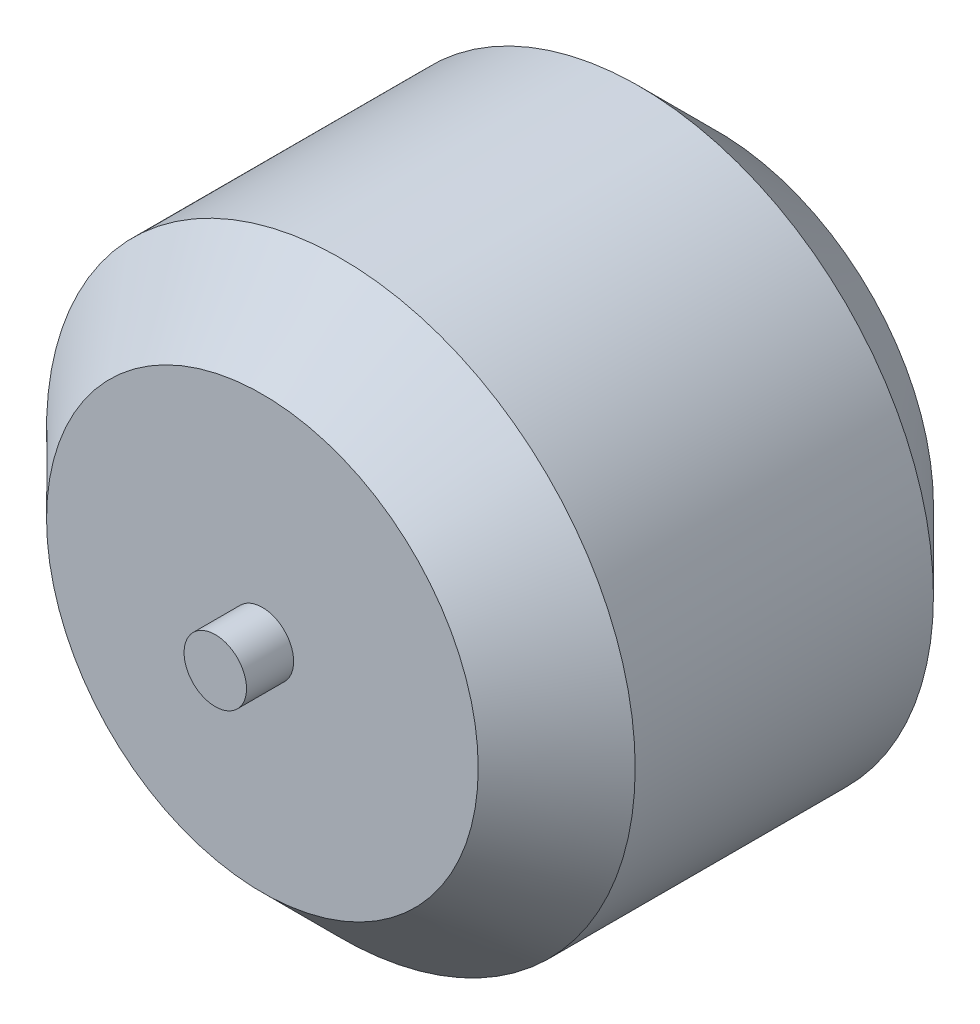
ISO-10303-21;
HEADER;
FILE_DESCRIPTION(('STEP AP214'),'2;1');
FILE_NAME('part.step','',(''),(''),'','','');
FILE_SCHEMA(('AUTOMOTIVE_DESIGN { 1 0 10303 214 1 1 1 1 }'));
ENDSEC;
DATA;
#1=APPLICATION_CONTEXT('core data for automotive mechanical design processes');
#2=APPLICATION_PROTOCOL_DEFINITION('international standard','automotive_design',2000,#1);
#3=PRODUCT_CONTEXT('',#1,'mechanical');
#4=PRODUCT('Part','Part','',(#3));
#5=PRODUCT_RELATED_PRODUCT_CATEGORY('part','',(#4));
#6=PRODUCT_DEFINITION_FORMATION('','',#4);
#7=PRODUCT_DEFINITION_CONTEXT('part definition',#1,'design');
#8=PRODUCT_DEFINITION('design','',#6,#7);
#9=PRODUCT_DEFINITION_SHAPE('','',#8);
#10=(LENGTH_UNIT() NAMED_UNIT(*) SI_UNIT(.MILLI.,.METRE.));
#11=(NAMED_UNIT(*) PLANE_ANGLE_UNIT() SI_UNIT($,.RADIAN.));
#12=(NAMED_UNIT(*) SI_UNIT($,.STERADIAN.) SOLID_ANGLE_UNIT());
#13=UNCERTAINTY_MEASURE_WITH_UNIT(LENGTH_MEASURE(1.E-05),#10,'distance_accuracy_value','');
#14=(GEOMETRIC_REPRESENTATION_CONTEXT(3) GLOBAL_UNCERTAINTY_ASSIGNED_CONTEXT((#13)) GLOBAL_UNIT_ASSIGNED_CONTEXT((#10,
#11,#12)) REPRESENTATION_CONTEXT('',''));
#15=CARTESIAN_POINT('',(0.,0.,0.));
#16=DIRECTION('',(0.,0.,1.));
#17=DIRECTION('',(1.,0.,0.));
#18=AXIS2_PLACEMENT_3D('',#15,#16,#17);
#19=CARTESIAN_POINT('',(0.,0.,29.));
#20=DIRECTION('',(0.,0.,-1.));
#21=DIRECTION('',(-1.,0.,0.));
#22=AXIS2_PLACEMENT_3D('',#19,#20,#21);
#23=CYLINDRICAL_SURFACE('',#22,18.75);
#24=CARTESIAN_POINT('',(0.,0.,5.00000000000004));
#25=DIRECTION('',(0.,0.,1.));
#26=DIRECTION('',(1.,0.,0.));
#27=AXIS2_PLACEMENT_3D('',#24,#25,#26);
#28=CIRCLE('',#27,18.75);
#29=CARTESIAN_POINT('',(18.75,0.,5.00000000000004));
#30=VERTEX_POINT('',#29);
#31=EDGE_CURVE('E58',#30,#30,#28,.T.);
#32=ORIENTED_EDGE('',*,*,#31,.T.);
#33=EDGE_LOOP('',(#32));
#34=FACE_BOUND('',#33,.T.);
#35=CARTESIAN_POINT('',(0.,0.,24.));
#36=DIRECTION('',(0.,0.,1.));
#37=DIRECTION('',(1.,0.,0.));
#38=AXIS2_PLACEMENT_3D('',#35,#36,#37);
#39=CIRCLE('',#38,18.75);
#40=CARTESIAN_POINT('',(18.75,0.,24.));
#41=VERTEX_POINT('',#40);
#42=EDGE_CURVE('E64',#41,#41,#39,.F.);
#43=ORIENTED_EDGE('',*,*,#42,.T.);
#44=EDGE_LOOP('',(#43));
#45=FACE_BOUND('',#44,.T.);
#46=ADVANCED_FACE('F39',(#34,#45),#23,.T.);
#47=CARTESIAN_POINT('',(0.,0.,29.));
#48=DIRECTION('',(0.,0.,1.));
#49=DIRECTION('',(1.,0.,0.));
#50=AXIS2_PLACEMENT_3D('',#47,#48,#49);
#51=PLANE('',#50);
#52=CARTESIAN_POINT('',(0.,0.,29.));
#53=DIRECTION('',(0.,0.,1.));
#54=DIRECTION('',(1.,0.,0.));
#55=AXIS2_PLACEMENT_3D('',#52,#53,#54);
#56=CIRCLE('',#55,13.75);
#57=CARTESIAN_POINT('',(13.75,0.,29.));
#58=VERTEX_POINT('',#57);
#59=EDGE_CURVE('E48',#58,#58,#56,.T.);
#60=ORIENTED_EDGE('',*,*,#59,.T.);
#61=EDGE_LOOP('',(#60));
#62=FACE_BOUND('',#61,.T.);
#63=CARTESIAN_POINT('',(0.,0.,29.));
#64=DIRECTION('',(0.,0.,1.));
#65=DIRECTION('',(1.,0.,0.));
#66=AXIS2_PLACEMENT_3D('',#63,#64,#65);
#67=CIRCLE('',#66,1.99);
#68=CARTESIAN_POINT('',(1.99,0.,29.));
#69=VERTEX_POINT('',#68);
#70=EDGE_CURVE('E69',#69,#69,#67,.T.);
#71=ORIENTED_EDGE('',*,*,#70,.F.);
#72=EDGE_LOOP('',(#71));
#73=FACE_BOUND('',#72,.T.);
#74=ADVANCED_FACE('F126',(#62,#73),#51,.T.);
#75=CARTESIAN_POINT('',(0.,0.,0.));
#76=DIRECTION('',(0.,0.,1.));
#77=DIRECTION('',(1.,0.,0.));
#78=AXIS2_PLACEMENT_3D('',#75,#76,#77);
#79=PLANE('',#78);
#80=CARTESIAN_POINT('',(8.,0.,0.));
#81=DIRECTION('',(0.,0.,-1.));
#82=DIRECTION('',(0.,1.,0.));
#83=AXIS2_PLACEMENT_3D('',#80,#81,#82);
#84=CIRCLE('',#83,1.5);
#85=CARTESIAN_POINT('',(8.00000000000001,1.49999999999997,0.));
#86=VERTEX_POINT('',#85);
#87=EDGE_CURVE('E105',#86,#86,#84,.T.);
#88=ORIENTED_EDGE('',*,*,#87,.F.);
#89=EDGE_LOOP('',(#88));
#90=FACE_BOUND('',#89,.T.);
#91=CARTESIAN_POINT('',(0.,-8.,0.));
#92=DIRECTION('',(0.,0.,-1.));
#93=DIRECTION('',(1.,0.,0.));
#94=AXIS2_PLACEMENT_3D('',#91,#92,#93);
#95=CIRCLE('',#94,1.5);
#96=CARTESIAN_POINT('',(1.5,-8.,0.));
#97=VERTEX_POINT('',#96);
#98=EDGE_CURVE('E97',#97,#97,#95,.T.);
#99=ORIENTED_EDGE('',*,*,#98,.F.);
#100=EDGE_LOOP('',(#99));
#101=FACE_BOUND('',#100,.T.);
#102=CARTESIAN_POINT('',(-8.,0.,0.));
#103=DIRECTION('',(0.,0.,-1.));
#104=DIRECTION('',(0.,-1.,0.));
#105=AXIS2_PLACEMENT_3D('',#102,#103,#104);
#106=CIRCLE('',#105,1.5);
#107=CARTESIAN_POINT('',(-8.00000000000002,-1.49999999999992,0.));
#108=VERTEX_POINT('',#107);
#109=EDGE_CURVE('E89',#108,#108,#106,.T.);
#110=ORIENTED_EDGE('',*,*,#109,.F.);
#111=EDGE_LOOP('',(#110));
#112=FACE_BOUND('',#111,.T.);
#113=CARTESIAN_POINT('',(0.,8.,0.));
#114=DIRECTION('',(0.,0.,-1.));
#115=DIRECTION('',(-1.,0.,0.));
#116=AXIS2_PLACEMENT_3D('',#113,#114,#115);
#117=CIRCLE('',#116,1.5);
#118=CARTESIAN_POINT('',(-1.5,8.,0.));
#119=VERTEX_POINT('',#118);
#120=EDGE_CURVE('E81',#119,#119,#117,.T.);
#121=ORIENTED_EDGE('',*,*,#120,.F.);
#122=EDGE_LOOP('',(#121));
#123=FACE_BOUND('',#122,.T.);
#124=CARTESIAN_POINT('',(0.,0.,0.));
#125=DIRECTION('',(0.,0.,1.));
#126=DIRECTION('',(1.,0.,0.));
#127=AXIS2_PLACEMENT_3D('',#124,#125,#126);
#128=CIRCLE('',#127,1.99);
#129=CARTESIAN_POINT('',(1.99,0.,0.));
#130=VERTEX_POINT('',#129);
#131=EDGE_CURVE('E10',#130,#130,#128,.F.);
#132=ORIENTED_EDGE('',*,*,#131,.F.);
#133=EDGE_LOOP('',(#132));
#134=FACE_BOUND('',#133,.T.);
#135=CARTESIAN_POINT('',(0.,0.,0.));
#136=DIRECTION('',(0.,0.,1.));
#137=DIRECTION('',(1.,0.,0.));
#138=AXIS2_PLACEMENT_3D('',#135,#136,#137);
#139=CIRCLE('',#138,13.7499999999999);
#140=CARTESIAN_POINT('',(13.7499999999999,0.,0.));
#141=VERTEX_POINT('',#140);
#142=EDGE_CURVE('E53',#141,#141,#139,.F.);
#143=ORIENTED_EDGE('',*,*,#142,.T.);
#144=EDGE_LOOP('',(#143));
#145=FACE_BOUND('',#144,.T.);
#146=ADVANCED_FACE('F122',(#90,#101,#112,#123,#134,#145),#79,.F.);
#147=CARTESIAN_POINT('',(0.,0.,32.));
#148=DIRECTION('',(0.,0.,-1.));
#149=DIRECTION('',(-1.,0.,0.));
#150=AXIS2_PLACEMENT_3D('',#147,#148,#149);
#151=CYLINDRICAL_SURFACE('',#150,1.99);
#152=CARTESIAN_POINT('',(0.,0.,32.));
#153=DIRECTION('',(0.,0.,1.));
#154=DIRECTION('',(1.,0.,0.));
#155=AXIS2_PLACEMENT_3D('',#152,#153,#154);
#156=CIRCLE('',#155,1.99);
#157=CARTESIAN_POINT('',(1.99,0.,32.));
#158=VERTEX_POINT('',#157);
#159=EDGE_CURVE('E68',#158,#158,#156,.T.);
#160=ORIENTED_EDGE('',*,*,#159,.F.);
#161=EDGE_LOOP('',(#160));
#162=FACE_BOUND('',#161,.T.);
#163=ORIENTED_EDGE('',*,*,#70,.T.);
#164=EDGE_LOOP('',(#163));
#165=FACE_BOUND('',#164,.T.);
#166=ADVANCED_FACE('F125',(#162,#165),#151,.T.);
#167=CARTESIAN_POINT('',(0.,0.,32.));
#168=DIRECTION('',(0.,0.,1.));
#169=DIRECTION('',(1.,0.,0.));
#170=AXIS2_PLACEMENT_3D('',#167,#168,#169);
#171=PLANE('',#170);
#172=ORIENTED_EDGE('',*,*,#159,.T.);
#173=EDGE_LOOP('',(#172));
#174=FACE_BOUND('',#173,.T.);
#175=ADVANCED_FACE('F140',(#174),#171,.T.);
#176=CARTESIAN_POINT('',(0.,0.,5.00000000000004));
#177=DIRECTION('',(0.,0.,1.));
#178=DIRECTION('',(1.,0.,0.));
#179=AXIS2_PLACEMENT_3D('',#176,#177,#178);
#180=CONICAL_SURFACE('',#179,18.75,0.78539816339745);
#181=ORIENTED_EDGE('',*,*,#142,.F.);
#182=EDGE_LOOP('',(#181));
#183=FACE_BOUND('',#182,.T.);
#184=ORIENTED_EDGE('',*,*,#31,.F.);
#185=EDGE_LOOP('',(#184));
#186=FACE_BOUND('',#185,.T.);
#187=ADVANCED_FACE('F137',(#183,#186),#180,.T.);
#188=CARTESIAN_POINT('',(0.,0.,29.));
#189=DIRECTION('',(0.,0.,-1.));
#190=DIRECTION('',(-1.,0.,0.));
#191=AXIS2_PLACEMENT_3D('',#188,#189,#190);
#192=CONICAL_SURFACE('',#191,13.75,0.785398163397447);
#193=ORIENTED_EDGE('',*,*,#42,.F.);
#194=EDGE_LOOP('',(#193));
#195=FACE_BOUND('',#194,.T.);
#196=ORIENTED_EDGE('',*,*,#59,.F.);
#197=EDGE_LOOP('',(#196));
#198=FACE_BOUND('',#197,.T.);
#199=ADVANCED_FACE('F42',(#195,#198),#192,.T.);
#200=CARTESIAN_POINT('',(0.,0.,-1.));
#201=DIRECTION('',(0.,0.,1.));
#202=DIRECTION('',(1.,0.,0.));
#203=AXIS2_PLACEMENT_3D('',#200,#201,#202);
#204=CYLINDRICAL_SURFACE('',#203,1.99);
#205=CARTESIAN_POINT('',(0.,0.,-1.));
#206=DIRECTION('',(0.,0.,-1.));
#207=DIRECTION('',(-1.,0.,0.));
#208=AXIS2_PLACEMENT_3D('',#205,#206,#207);
#209=CIRCLE('',#208,1.99);
#210=CARTESIAN_POINT('',(-1.99,0.,-1.));
#211=VERTEX_POINT('',#210);
#212=EDGE_CURVE('E73',#211,#211,#209,.T.);
#213=ORIENTED_EDGE('',*,*,#212,.F.);
#214=EDGE_LOOP('',(#213));
#215=FACE_BOUND('',#214,.T.);
#216=ORIENTED_EDGE('',*,*,#131,.T.);
#217=EDGE_LOOP('',(#216));
#218=FACE_BOUND('',#217,.T.);
#219=ADVANCED_FACE('F150',(#215,#218),#204,.T.);
#220=CARTESIAN_POINT('',(0.,0.,-1.));
#221=DIRECTION('',(0.,0.,-1.));
#222=DIRECTION('',(-1.,0.,0.));
#223=AXIS2_PLACEMENT_3D('',#220,#221,#222);
#224=PLANE('',#223);
#225=ORIENTED_EDGE('',*,*,#212,.T.);
#226=EDGE_LOOP('',(#225));
#227=FACE_BOUND('',#226,.T.);
#228=ADVANCED_FACE('F154',(#227),#224,.T.);
#229=CARTESIAN_POINT('',(0.,8.,1.));
#230=DIRECTION('',(0.,0.,-1.));
#231=DIRECTION('',(-1.,0.,0.));
#232=AXIS2_PLACEMENT_3D('',#229,#230,#231);
#233=CYLINDRICAL_SURFACE('',#232,1.5);
#234=CARTESIAN_POINT('',(0.,8.,1.));
#235=DIRECTION('',(0.,0.,-1.));
#236=DIRECTION('',(-1.,0.,0.));
#237=AXIS2_PLACEMENT_3D('',#234,#235,#236);
#238=CIRCLE('',#237,1.5);
#239=CARTESIAN_POINT('',(-1.5,8.,1.));
#240=VERTEX_POINT('',#239);
#241=EDGE_CURVE('E80',#240,#240,#238,.T.);
#242=ORIENTED_EDGE('',*,*,#241,.F.);
#243=EDGE_LOOP('',(#242));
#244=FACE_BOUND('',#243,.T.);
#245=ORIENTED_EDGE('',*,*,#120,.T.);
#246=EDGE_LOOP('',(#245));
#247=FACE_BOUND('',#246,.T.);
#248=ADVANCED_FACE('F160',(#244,#247),#233,.F.);
#249=CARTESIAN_POINT('',(0.,8.,1.));
#250=DIRECTION('',(0.,0.,-1.));
#251=DIRECTION('',(-1.,0.,0.));
#252=AXIS2_PLACEMENT_3D('',#249,#250,#251);
#253=PLANE('',#252);
#254=ORIENTED_EDGE('',*,*,#241,.T.);
#255=EDGE_LOOP('',(#254));
#256=FACE_BOUND('',#255,.T.);
#257=ADVANCED_FACE('F225',(#256),#253,.T.);
#258=CARTESIAN_POINT('',(-8.,0.,1.));
#259=DIRECTION('',(0.,0.,-1.));
#260=DIRECTION('',(-1.,0.,0.));
#261=AXIS2_PLACEMENT_3D('',#258,#259,#260);
#262=CYLINDRICAL_SURFACE('',#261,1.5);
#263=CARTESIAN_POINT('',(-8.,0.,1.));
#264=DIRECTION('',(0.,0.,-1.));
#265=DIRECTION('',(0.,-1.,0.));
#266=AXIS2_PLACEMENT_3D('',#263,#264,#265);
#267=CIRCLE('',#266,1.5);
#268=CARTESIAN_POINT('',(-8.00000000000002,-1.49999999999992,1.));
#269=VERTEX_POINT('',#268);
#270=EDGE_CURVE('E93',#269,#269,#267,.T.);
#271=ORIENTED_EDGE('',*,*,#270,.F.);
#272=EDGE_LOOP('',(#271));
#273=FACE_BOUND('',#272,.T.);
#274=ORIENTED_EDGE('',*,*,#109,.T.);
#275=EDGE_LOOP('',(#274));
#276=FACE_BOUND('',#275,.T.);
#277=ADVANCED_FACE('F233',(#273,#276),#262,.F.);
#278=CARTESIAN_POINT('',(-8.,0.,1.));
#279=DIRECTION('',(0.,0.,-1.));
#280=DIRECTION('',(0.,-1.,0.));
#281=AXIS2_PLACEMENT_3D('',#278,#279,#280);
#282=PLANE('',#281);
#283=ORIENTED_EDGE('',*,*,#270,.T.);
#284=EDGE_LOOP('',(#283));
#285=FACE_BOUND('',#284,.T.);
#286=ADVANCED_FACE('F243',(#285),#282,.T.);
#287=CARTESIAN_POINT('',(0.,-8.,1.));
#288=DIRECTION('',(0.,0.,-1.));
#289=DIRECTION('',(-1.,0.,0.));
#290=AXIS2_PLACEMENT_3D('',#287,#288,#289);
#291=CYLINDRICAL_SURFACE('',#290,1.5);
#292=CARTESIAN_POINT('',(0.,-8.,1.));
#293=DIRECTION('',(0.,0.,-1.));
#294=DIRECTION('',(1.,0.,0.));
#295=AXIS2_PLACEMENT_3D('',#292,#293,#294);
#296=CIRCLE('',#295,1.5);
#297=CARTESIAN_POINT('',(1.5,-8.,1.));
#298=VERTEX_POINT('',#297);
#299=EDGE_CURVE('E101',#298,#298,#296,.T.);
#300=ORIENTED_EDGE('',*,*,#299,.F.);
#301=EDGE_LOOP('',(#300));
#302=FACE_BOUND('',#301,.T.);
#303=ORIENTED_EDGE('',*,*,#98,.T.);
#304=EDGE_LOOP('',(#303));
#305=FACE_BOUND('',#304,.T.);
#306=ADVANCED_FACE('F250',(#302,#305),#291,.F.);
#307=CARTESIAN_POINT('',(0.,-8.,1.));
#308=DIRECTION('',(0.,0.,-1.));
#309=DIRECTION('',(1.,0.,0.));
#310=AXIS2_PLACEMENT_3D('',#307,#308,#309);
#311=PLANE('',#310);
#312=ORIENTED_EDGE('',*,*,#299,.T.);
#313=EDGE_LOOP('',(#312));
#314=FACE_BOUND('',#313,.T.);
#315=ADVANCED_FACE('F118',(#314),#311,.T.);
#316=CARTESIAN_POINT('',(8.,0.,1.));
#317=DIRECTION('',(0.,0.,-1.));
#318=DIRECTION('',(-1.,0.,0.));
#319=AXIS2_PLACEMENT_3D('',#316,#317,#318);
#320=CYLINDRICAL_SURFACE('',#319,1.5);
#321=CARTESIAN_POINT('',(8.,0.,1.));
#322=DIRECTION('',(0.,0.,-1.));
#323=DIRECTION('',(0.,1.,0.));
#324=AXIS2_PLACEMENT_3D('',#321,#322,#323);
#325=CIRCLE('',#324,1.5);
#326=CARTESIAN_POINT('',(8.00000000000001,1.49999999999997,1.));
#327=VERTEX_POINT('',#326);
#328=EDGE_CURVE('E85',#327,#327,#325,.T.);
#329=ORIENTED_EDGE('',*,*,#328,.F.);
#330=EDGE_LOOP('',(#329));
#331=FACE_BOUND('',#330,.T.);
#332=ORIENTED_EDGE('',*,*,#87,.T.);
#333=EDGE_LOOP('',(#332));
#334=FACE_BOUND('',#333,.T.);
#335=ADVANCED_FACE('F115',(#331,#334),#320,.F.);
#336=CARTESIAN_POINT('',(8.,0.,1.));
#337=DIRECTION('',(0.,0.,-1.));
#338=DIRECTION('',(0.,1.,0.));
#339=AXIS2_PLACEMENT_3D('',#336,#337,#338);
#340=PLANE('',#339);
#341=ORIENTED_EDGE('',*,*,#328,.T.);
#342=EDGE_LOOP('',(#341));
#343=FACE_BOUND('',#342,.T.);
#344=ADVANCED_FACE('F113',(#343),#340,.T.);
#345=CLOSED_SHELL('',(#46,#74,#146,#166,#175,#187,#199,#219,#228,#248,#257,#277,#286,#306,#315,
#335,#344));
#346=MANIFOLD_SOLID_BREP('B2',#345);
#347=ADVANCED_BREP_SHAPE_REPRESENTATION('',(#18,#346),#14);
#348=SHAPE_DEFINITION_REPRESENTATION(#9,#347);
ENDSEC;
END-ISO-10303-21;
